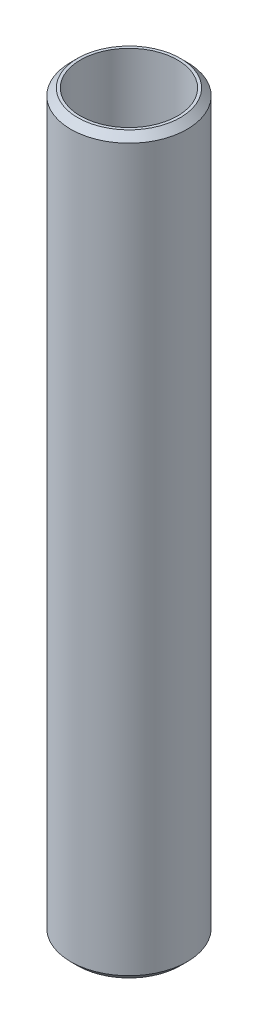
ISO-10303-21;
HEADER;
FILE_DESCRIPTION(('STEP AP214'),'2;1');
FILE_NAME('part.step','',(''),(''),'','','');
FILE_SCHEMA(('AUTOMOTIVE_DESIGN { 1 0 10303 214 1 1 1 1 }'));
ENDSEC;
DATA;
#1=APPLICATION_CONTEXT('core data for automotive mechanical design processes');
#2=APPLICATION_PROTOCOL_DEFINITION('international standard','automotive_design',2000,#1);
#3=PRODUCT_CONTEXT('',#1,'mechanical');
#4=PRODUCT('Part','Part','',(#3));
#5=PRODUCT_RELATED_PRODUCT_CATEGORY('part','',(#4));
#6=PRODUCT_DEFINITION_FORMATION('','',#4);
#7=PRODUCT_DEFINITION_CONTEXT('part definition',#1,'design');
#8=PRODUCT_DEFINITION('design','',#6,#7);
#9=PRODUCT_DEFINITION_SHAPE('','',#8);
#10=(LENGTH_UNIT() NAMED_UNIT(*) SI_UNIT(.MILLI.,.METRE.));
#11=(NAMED_UNIT(*) PLANE_ANGLE_UNIT() SI_UNIT($,.RADIAN.));
#12=(NAMED_UNIT(*) SI_UNIT($,.STERADIAN.) SOLID_ANGLE_UNIT());
#13=UNCERTAINTY_MEASURE_WITH_UNIT(LENGTH_MEASURE(1.E-05),#10,'distance_accuracy_value','');
#14=(GEOMETRIC_REPRESENTATION_CONTEXT(3) GLOBAL_UNCERTAINTY_ASSIGNED_CONTEXT((#13)) GLOBAL_UNIT_ASSIGNED_CONTEXT((#10,
#11,#12)) REPRESENTATION_CONTEXT('',''));
#15=CARTESIAN_POINT('',(0.,0.,0.));
#16=DIRECTION('',(0.,0.,1.));
#17=DIRECTION('',(1.,0.,0.));
#18=AXIS2_PLACEMENT_3D('',#15,#16,#17);
#19=CARTESIAN_POINT('',(0.,600.,0.));
#20=DIRECTION('',(0.,-1.,0.));
#21=DIRECTION('',(0.,0.,-1.));
#22=AXIS2_PLACEMENT_3D('',#19,#20,#21);
#23=CYLINDRICAL_SURFACE('',#22,47.5);
#24=CARTESIAN_POINT('',(0.,594.472737732505,0.));
#25=DIRECTION('',(0.,1.,0.));
#26=DIRECTION('',(0.,0.,1.));
#27=AXIS2_PLACEMENT_3D('',#24,#25,#26);
#28=CIRCLE('',#27,47.5);
#29=CARTESIAN_POINT('',(0.,594.472737732505,47.5));
#30=VERTEX_POINT('',#29);
#31=EDGE_CURVE('E50',#30,#30,#28,.F.);
#32=ORIENTED_EDGE('',*,*,#31,.T.);
#33=EDGE_LOOP('',(#32));
#34=FACE_BOUND('',#33,.T.);
#35=CARTESIAN_POINT('',(0.,5.52726226749511,0.));
#36=DIRECTION('',(0.,1.,0.));
#37=DIRECTION('',(0.,0.,1.));
#38=AXIS2_PLACEMENT_3D('',#35,#36,#37);
#39=CIRCLE('',#38,47.5);
#40=CARTESIAN_POINT('',(0.,5.52726226749511,47.5));
#41=VERTEX_POINT('',#40);
#42=EDGE_CURVE('E51',#41,#41,#39,.T.);
#43=ORIENTED_EDGE('',*,*,#42,.T.);
#44=EDGE_LOOP('',(#43));
#45=FACE_BOUND('',#44,.T.);
#46=ADVANCED_FACE('F39',(#34,#45),#23,.T.);
#47=CARTESIAN_POINT('',(0.,600.,0.));
#48=DIRECTION('',(0.,1.,0.));
#49=DIRECTION('',(0.,0.,1.));
#50=AXIS2_PLACEMENT_3D('',#47,#48,#49);
#51=PLANE('',#50);
#52=CARTESIAN_POINT('',(0.,600.,0.));
#53=DIRECTION('',(0.,1.,0.));
#54=DIRECTION('',(0.,0.,1.));
#55=AXIS2_PLACEMENT_3D('',#52,#53,#54);
#56=CIRCLE('',#55,41.9727377325048);
#57=CARTESIAN_POINT('',(0.,600.,41.9727377325048));
#58=VERTEX_POINT('',#57);
#59=EDGE_CURVE('E54',#58,#58,#56,.T.);
#60=ORIENTED_EDGE('',*,*,#59,.T.);
#61=EDGE_LOOP('',(#60));
#62=FACE_BOUND('',#61,.T.);
#63=CARTESIAN_POINT('',(0.,600.,0.));
#64=DIRECTION('',(0.,1.,0.));
#65=DIRECTION('',(0.,0.,1.));
#66=AXIS2_PLACEMENT_3D('',#63,#64,#65);
#67=CIRCLE('',#66,39.6805431109406);
#68=CARTESIAN_POINT('',(0.,600.,39.6805431109406));
#69=VERTEX_POINT('',#68);
#70=EDGE_CURVE('E58',#69,#69,#67,.T.);
#71=ORIENTED_EDGE('',*,*,#70,.F.);
#72=EDGE_LOOP('',(#71));
#73=FACE_BOUND('',#72,.T.);
#74=ADVANCED_FACE('F69',(#62,#73),#51,.T.);
#75=CARTESIAN_POINT('',(0.,0.,0.));
#76=DIRECTION('',(0.,1.,0.));
#77=DIRECTION('',(0.,0.,1.));
#78=AXIS2_PLACEMENT_3D('',#75,#76,#77);
#79=PLANE('',#78);
#80=CARTESIAN_POINT('',(0.,0.,0.));
#81=DIRECTION('',(0.,1.,0.));
#82=DIRECTION('',(0.,0.,1.));
#83=AXIS2_PLACEMENT_3D('',#80,#81,#82);
#84=CIRCLE('',#83,41.9727377325049);
#85=CARTESIAN_POINT('',(0.,0.,41.9727377325049));
#86=VERTEX_POINT('',#85);
#87=EDGE_CURVE('E10',#86,#86,#84,.F.);
#88=ORIENTED_EDGE('',*,*,#87,.T.);
#89=EDGE_LOOP('',(#88));
#90=FACE_BOUND('',#89,.T.);
#91=CARTESIAN_POINT('',(0.,0.,0.));
#92=DIRECTION('',(0.,1.,0.));
#93=DIRECTION('',(0.,0.,1.));
#94=AXIS2_PLACEMENT_3D('',#91,#92,#93);
#95=CIRCLE('',#94,39.6805431109406);
#96=CARTESIAN_POINT('',(0.,0.,39.6805431109406));
#97=VERTEX_POINT('',#96);
#98=EDGE_CURVE('E63',#97,#97,#95,.T.);
#99=ORIENTED_EDGE('',*,*,#98,.T.);
#100=EDGE_LOOP('',(#99));
#101=FACE_BOUND('',#100,.T.);
#102=ADVANCED_FACE('F75',(#90,#101),#79,.F.);
#103=CARTESIAN_POINT('',(0.,600.,0.));
#104=DIRECTION('',(0.,-1.,0.));
#105=DIRECTION('',(0.,0.,-1.));
#106=AXIS2_PLACEMENT_3D('',#103,#104,#105);
#107=CYLINDRICAL_SURFACE('',#106,39.6805431109406);
#108=ORIENTED_EDGE('',*,*,#70,.T.);
#109=EDGE_LOOP('',(#108));
#110=FACE_BOUND('',#109,.T.);
#111=ORIENTED_EDGE('',*,*,#98,.F.);
#112=EDGE_LOOP('',(#111));
#113=FACE_BOUND('',#112,.T.);
#114=ADVANCED_FACE('F70',(#110,#113),#107,.F.);
#115=CARTESIAN_POINT('',(0.,600.,0.));
#116=DIRECTION('',(0.,-1.,0.));
#117=DIRECTION('',(0.,0.,-1.));
#118=AXIS2_PLACEMENT_3D('',#115,#116,#117);
#119=CONICAL_SURFACE('',#118,41.9727377325048,0.785398163397445);
#120=ORIENTED_EDGE('',*,*,#31,.F.);
#121=EDGE_LOOP('',(#120));
#122=FACE_BOUND('',#121,.T.);
#123=ORIENTED_EDGE('',*,*,#59,.F.);
#124=EDGE_LOOP('',(#123));
#125=FACE_BOUND('',#124,.T.);
#126=ADVANCED_FACE('F81',(#122,#125),#119,.T.);
#127=CARTESIAN_POINT('',(0.,5.52726226749511,0.));
#128=DIRECTION('',(0.,1.,0.));
#129=DIRECTION('',(0.,0.,1.));
#130=AXIS2_PLACEMENT_3D('',#127,#128,#129);
#131=CONICAL_SURFACE('',#130,47.5,0.78539816339745);
#132=CARTESIAN_POINT('',(0.,0.,41.9727377325049));
#133=CARTESIAN_POINT('',(0.,0.0575756486197399,42.0303133811246));
#134=CARTESIAN_POINT('',(0.,0.115151297239481,42.0878890297444));
#135=CARTESIAN_POINT('',(0.,0.230302594478962,42.2030403269838));
#136=CARTESIAN_POINT('',(0.,0.287878243098703,42.2606159756036));
#137=CARTESIAN_POINT('',(0.,0.403029540338184,42.3757672728431));
#138=CARTESIAN_POINT('',(0.,0.460605188957925,42.4333429214628));
#139=CARTESIAN_POINT('',(0.,0.575756486197407,42.5484942187023));
#140=CARTESIAN_POINT('',(0.,0.633332134817148,42.606069867322));
#141=CARTESIAN_POINT('',(0.,0.748483432056629,42.7212211645615));
#142=CARTESIAN_POINT('',(0.,0.80605908067637,42.7787968131812));
#143=CARTESIAN_POINT('',(0.,0.921210377915851,42.8939481104207));
#144=CARTESIAN_POINT('',(0.,0.978786026535592,42.9515237590405));
#145=CARTESIAN_POINT('',(0.,1.09393732377507,43.0666750562799));
#146=CARTESIAN_POINT('',(0.,1.15151297239481,43.1242507048997));
#147=CARTESIAN_POINT('',(0.,1.2666642696343,43.2394020021392));
#148=CARTESIAN_POINT('',(0.,1.32423991825404,43.2969776507589));
#149=CARTESIAN_POINT('',(0.,1.43939121549352,43.4121289479984));
#150=CARTESIAN_POINT('',(0.,1.49696686411326,43.4697045966181));
#151=CARTESIAN_POINT('',(0.,1.61211816135274,43.5848558938576));
#152=CARTESIAN_POINT('',(0.,1.66969380997248,43.6424315424774));
#153=CARTESIAN_POINT('',(0.,1.78484510721196,43.7575828397168));
#154=CARTESIAN_POINT('',(0.,1.8424207558317,43.8151584883366));
#155=CARTESIAN_POINT('',(0.,1.95757205307119,43.9303097855761));
#156=CARTESIAN_POINT('',(0.,2.01514770169093,43.9878854341958));
#157=CARTESIAN_POINT('',(0.,2.13029899893041,44.1030367314353));
#158=CARTESIAN_POINT('',(0.,2.18787464755015,44.160612380055));
#159=CARTESIAN_POINT('',(0.,2.30302594478963,44.2757636772945));
#160=CARTESIAN_POINT('',(0.,2.36060159340937,44.3333393259143));
#161=CARTESIAN_POINT('',(0.,2.47575289064885,44.4484906231537));
#162=CARTESIAN_POINT('',(0.,2.53332853926859,44.5060662717735));
#163=CARTESIAN_POINT('',(0.,2.64847983650807,44.621217569013));
#164=CARTESIAN_POINT('',(0.,2.70605548512782,44.6787932176327));
#165=CARTESIAN_POINT('',(0.,2.8212067823673,44.7939445148722));
#166=CARTESIAN_POINT('',(0.,2.87878243098704,44.8515201634919));
#167=CARTESIAN_POINT('',(0.,2.99393372822652,44.9666714607314));
#168=CARTESIAN_POINT('',(0.,3.05150937684626,45.0242471093511));
#169=CARTESIAN_POINT('',(0.,3.16666067408574,45.1393984065906));
#170=CARTESIAN_POINT('',(0.,3.22423632270548,45.1969740552104));
#171=CARTESIAN_POINT('',(0.,3.33938761994496,45.3121253524498));
#172=CARTESIAN_POINT('',(0.,3.39696326856471,45.3697010010696));
#173=CARTESIAN_POINT('',(0.,3.51211456580419,45.4848522983091));
#174=CARTESIAN_POINT('',(0.,3.56969021442393,45.5424279469288));
#175=CARTESIAN_POINT('',(0.,3.68484151166341,45.6575792441683));
#176=CARTESIAN_POINT('',(0.,3.74241716028315,45.715154892788));
#177=CARTESIAN_POINT('',(0.,3.85756845752263,45.8303061900275));
#178=CARTESIAN_POINT('',(0.,3.91514410614237,45.8878818386473));
#179=CARTESIAN_POINT('',(0.,4.03029540338185,46.0030331358867));
#180=CARTESIAN_POINT('',(0.,4.08787105200159,46.0606087845065));
#181=CARTESIAN_POINT('',(0.,4.20302234924108,46.175760081746));
#182=CARTESIAN_POINT('',(0.,4.26059799786082,46.2333357303657));
#183=CARTESIAN_POINT('',(0.,4.3757492951003,46.3484870276052));
#184=CARTESIAN_POINT('',(0.,4.43332494372004,46.4060626762249));
#185=CARTESIAN_POINT('',(0.,4.54847624095952,46.5212139734644));
#186=CARTESIAN_POINT('',(0.,4.60605188957926,46.5787896220842));
#187=CARTESIAN_POINT('',(0.,4.72120318681874,46.6939409193236));
#188=CARTESIAN_POINT('',(0.,4.77877883543848,46.7515165679434));
#189=CARTESIAN_POINT('',(0.,4.89393013267797,46.8666678651829));
#190=CARTESIAN_POINT('',(0.,4.95150578129771,46.9242435138026));
#191=CARTESIAN_POINT('',(0.,5.06665707853719,47.0393948110421));
#192=CARTESIAN_POINT('',(0.,5.12423272715693,47.0969704596618));
#193=CARTESIAN_POINT('',(0.,5.23938402439641,47.2121217569013));
#194=CARTESIAN_POINT('',(0.,5.29695967301615,47.269697405521));
#195=CARTESIAN_POINT('',(0.,5.41211097025563,47.3848487027605));
#196=CARTESIAN_POINT('',(0.,5.46968661887537,47.4424243513803));
#197=CARTESIAN_POINT('',(0.,5.52726226749511,47.5));
#198=B_SPLINE_CURVE_WITH_KNOTS('',3,(#132,#133,#134,#135,#136,#137,#138,#139,#140,#141,#142,
#143,#144,#145,#146,#147,#148,#149,#150,#151,#152,#153,#154,#155,#156,#157,#158,#159,#160,#161,
#162,#163,#164,#165,#166,#167,#168,#169,#170,#171,#172,#173,#174,#175,#176,#177,#178,#179,#180,
#181,#182,#183,#184,#185,#186,#187,#188,#189,#190,#191,#192,#193,#194,#195,#196,#197),
.UNSPECIFIED.,.F.,.F.,(4,2,2,2,2,2,2,2,2,2,2,2,2,2,2,2,2,2,2,2,2,2,2,2,2,2,2,2,2,2,2,2,4),(0.,
0.244272789421396,0.488545578842791,0.732818368264187,0.977091157685582,1.22136394710698,
1.46563673652837,1.70990952594977,1.95418231537116,2.19845510479256,2.44272789421396,
2.68700068363536,2.93127347305675,3.17554626247815,3.41981905189954,3.66409184132094,
3.90836463074233,4.15263742016373,4.39691020958513,4.64118299900653,4.88545578842792,
5.12972857784932,5.37400136727071,5.61827415669211,5.8625469461135,6.1068197355349,
6.35109252495629,6.59536531437769,6.83963810379909,7.08391089322049,7.32818368264188,
7.57245647206328,7.81672926148467),.UNSPECIFIED.);
#199=EDGE_CURVE('BSEAM45',#86,#41,#198,.T.);
#200=ORIENTED_EDGE('',*,*,#87,.F.);
#201=ORIENTED_EDGE('',*,*,#42,.F.);
#202=ORIENTED_EDGE('',*,*,#199,.T.);
#203=ORIENTED_EDGE('',*,*,#199,.F.);
#204=EDGE_LOOP('',(#200,#202,#201,#203));
#205=FACE_BOUND('',#204,.T.);
#206=ADVANCED_FACE('F45',(#205),#131,.T.);
#207=CLOSED_SHELL('',(#46,#74,#102,#114,#126,#206));
#208=MANIFOLD_SOLID_BREP('B2',#207);
#209=ADVANCED_BREP_SHAPE_REPRESENTATION('',(#18,#208),#14);
#210=SHAPE_DEFINITION_REPRESENTATION(#9,#209);
ENDSEC;
END-ISO-10303-21;
